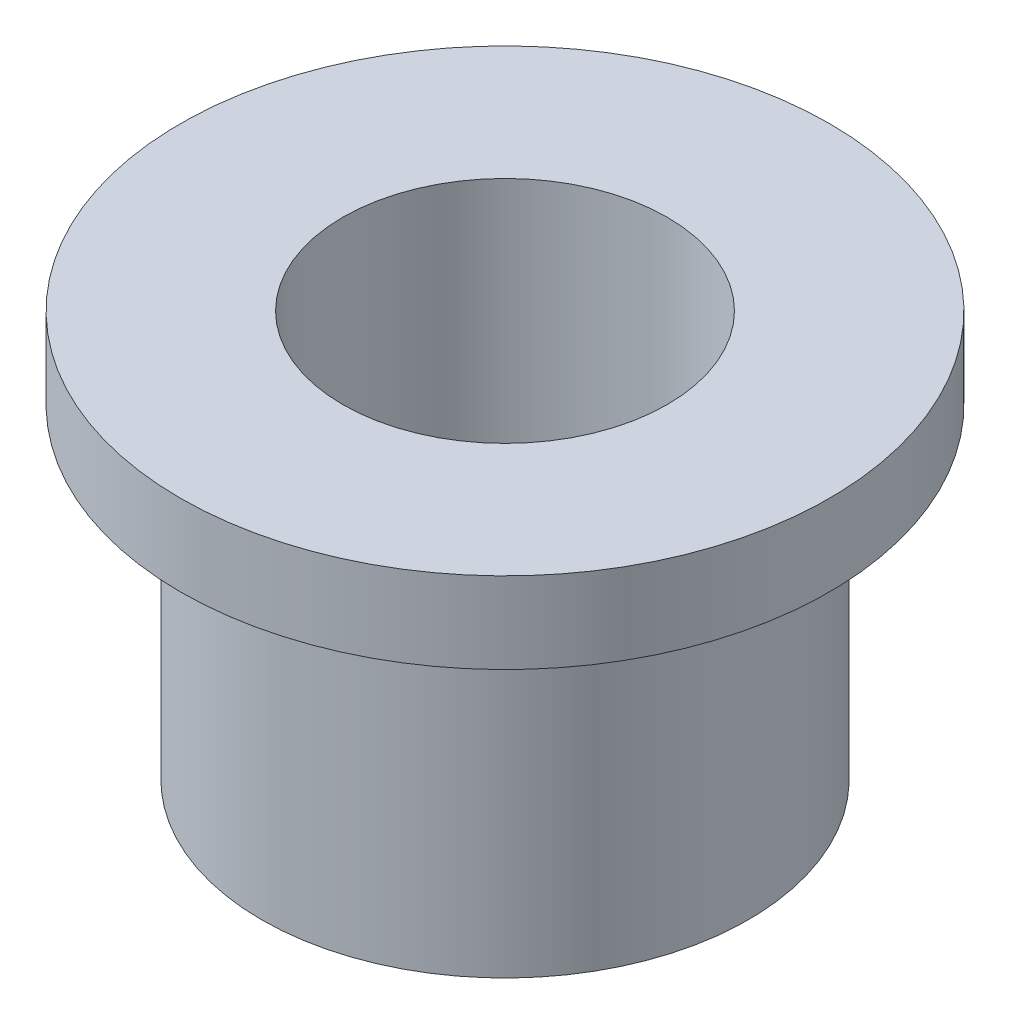
ISO-10303-21;
HEADER;
FILE_DESCRIPTION(('STEP AP214'),'2;1');
FILE_NAME('part.step','',(''),(''),'','','');
FILE_SCHEMA(('AUTOMOTIVE_DESIGN { 1 0 10303 214 1 1 1 1 }'));
ENDSEC;
DATA;
#1=APPLICATION_CONTEXT('core data for automotive mechanical design processes');
#2=APPLICATION_PROTOCOL_DEFINITION('international standard','automotive_design',2000,#1);
#3=PRODUCT_CONTEXT('',#1,'mechanical');
#4=PRODUCT('Part','Part','',(#3));
#5=PRODUCT_RELATED_PRODUCT_CATEGORY('part','',(#4));
#6=PRODUCT_DEFINITION_FORMATION('','',#4);
#7=PRODUCT_DEFINITION_CONTEXT('part definition',#1,'design');
#8=PRODUCT_DEFINITION('design','',#6,#7);
#9=PRODUCT_DEFINITION_SHAPE('','',#8);
#10=(LENGTH_UNIT() NAMED_UNIT(*) SI_UNIT(.MILLI.,.METRE.));
#11=(NAMED_UNIT(*) PLANE_ANGLE_UNIT() SI_UNIT($,.RADIAN.));
#12=(NAMED_UNIT(*) SI_UNIT($,.STERADIAN.) SOLID_ANGLE_UNIT());
#13=UNCERTAINTY_MEASURE_WITH_UNIT(LENGTH_MEASURE(1.E-05),#10,'distance_accuracy_value','');
#14=(GEOMETRIC_REPRESENTATION_CONTEXT(3) GLOBAL_UNCERTAINTY_ASSIGNED_CONTEXT((#13)) GLOBAL_UNIT_ASSIGNED_CONTEXT((#10,
#11,#12)) REPRESENTATION_CONTEXT('',''));
#15=CARTESIAN_POINT('',(0.,0.,0.));
#16=DIRECTION('',(0.,0.,1.));
#17=DIRECTION('',(1.,0.,0.));
#18=AXIS2_PLACEMENT_3D('',#15,#16,#17);
#19=CARTESIAN_POINT('',(-50.,0.,0.));
#20=DIRECTION('',(0.,-1.,0.));
#21=DIRECTION('',(0.,0.,-1.));
#22=AXIS2_PLACEMENT_3D('',#19,#20,#21);
#23=PLANE('',#22);
#24=CARTESIAN_POINT('',(0.,0.,0.));
#25=DIRECTION('',(0.,1.,0.));
#26=DIRECTION('',(0.,0.,1.));
#27=AXIS2_PLACEMENT_3D('',#24,#25,#26);
#28=CIRCLE('',#27,50.);
#29=CARTESIAN_POINT('',(0.,0.,50.));
#30=VERTEX_POINT('',#29);
#31=EDGE_CURVE('E69',#30,#30,#28,.T.);
#32=ORIENTED_EDGE('',*,*,#31,.T.);
#33=EDGE_LOOP('',(#32));
#34=FACE_BOUND('',#33,.T.);
#35=CARTESIAN_POINT('',(0.,0.,0.));
#36=DIRECTION('',(0.,1.,0.));
#37=DIRECTION('',(0.,0.,1.));
#38=AXIS2_PLACEMENT_3D('',#35,#36,#37);
#39=CIRCLE('',#38,75.);
#40=CARTESIAN_POINT('',(0.,0.,75.));
#41=VERTEX_POINT('',#40);
#42=EDGE_CURVE('E10',#41,#41,#39,.T.);
#43=ORIENTED_EDGE('',*,*,#42,.F.);
#44=EDGE_LOOP('',(#43));
#45=FACE_BOUND('',#44,.T.);
#46=ADVANCED_FACE('F41',(#34,#45),#23,.T.);
#47=CARTESIAN_POINT('',(0.,167.383783148187,0.));
#48=DIRECTION('',(0.,1.,0.));
#49=DIRECTION('',(0.,0.,1.));
#50=AXIS2_PLACEMENT_3D('',#47,#48,#49);
#51=CYLINDRICAL_SURFACE('',#50,75.);
#52=ORIENTED_EDGE('',*,*,#42,.T.);
#53=EDGE_LOOP('',(#52));
#54=FACE_BOUND('',#53,.T.);
#55=CARTESIAN_POINT('',(0.,100.,0.));
#56=DIRECTION('',(0.,1.,0.));
#57=DIRECTION('',(0.,0.,1.));
#58=AXIS2_PLACEMENT_3D('',#55,#56,#57);
#59=CIRCLE('',#58,75.);
#60=CARTESIAN_POINT('',(0.,100.,75.));
#61=VERTEX_POINT('',#60);
#62=EDGE_CURVE('E48',#61,#61,#59,.T.);
#63=ORIENTED_EDGE('',*,*,#62,.F.);
#64=EDGE_LOOP('',(#63));
#65=FACE_BOUND('',#64,.T.);
#66=ADVANCED_FACE('F86',(#54,#65),#51,.T.);
#67=CARTESIAN_POINT('',(-75.,100.,0.));
#68=DIRECTION('',(0.,-1.,0.));
#69=DIRECTION('',(0.,0.,-1.));
#70=AXIS2_PLACEMENT_3D('',#67,#68,#69);
#71=PLANE('',#70);
#72=ORIENTED_EDGE('',*,*,#62,.T.);
#73=EDGE_LOOP('',(#72));
#74=FACE_BOUND('',#73,.T.);
#75=CARTESIAN_POINT('',(0.,100.,0.));
#76=DIRECTION('',(0.,1.,0.));
#77=DIRECTION('',(0.,0.,1.));
#78=AXIS2_PLACEMENT_3D('',#75,#76,#77);
#79=CIRCLE('',#78,100.);
#80=CARTESIAN_POINT('',(0.,100.,100.));
#81=VERTEX_POINT('',#80);
#82=EDGE_CURVE('E55',#81,#81,#79,.T.);
#83=ORIENTED_EDGE('',*,*,#82,.F.);
#84=EDGE_LOOP('',(#83));
#85=FACE_BOUND('',#84,.T.);
#86=ADVANCED_FACE('F89',(#74,#85),#71,.T.);
#87=CARTESIAN_POINT('',(0.,167.383783148187,0.));
#88=DIRECTION('',(0.,1.,0.));
#89=DIRECTION('',(0.,0.,1.));
#90=AXIS2_PLACEMENT_3D('',#87,#88,#89);
#91=CYLINDRICAL_SURFACE('',#90,100.);
#92=ORIENTED_EDGE('',*,*,#82,.T.);
#93=EDGE_LOOP('',(#92));
#94=FACE_BOUND('',#93,.T.);
#95=CARTESIAN_POINT('',(0.,125.,0.));
#96=DIRECTION('',(0.,1.,0.));
#97=DIRECTION('',(0.,0.,1.));
#98=AXIS2_PLACEMENT_3D('',#95,#96,#97);
#99=CIRCLE('',#98,100.);
#100=CARTESIAN_POINT('',(0.,125.,100.));
#101=VERTEX_POINT('',#100);
#102=EDGE_CURVE('E61',#101,#101,#99,.T.);
#103=ORIENTED_EDGE('',*,*,#102,.F.);
#104=EDGE_LOOP('',(#103));
#105=FACE_BOUND('',#104,.T.);
#106=ADVANCED_FACE('F82',(#94,#105),#91,.T.);
#107=CARTESIAN_POINT('',(-100.,125.,0.));
#108=DIRECTION('',(0.,1.,0.));
#109=DIRECTION('',(0.,0.,1.));
#110=AXIS2_PLACEMENT_3D('',#107,#108,#109);
#111=PLANE('',#110);
#112=ORIENTED_EDGE('',*,*,#102,.T.);
#113=EDGE_LOOP('',(#112));
#114=FACE_BOUND('',#113,.T.);
#115=CARTESIAN_POINT('',(0.,125.,0.));
#116=DIRECTION('',(0.,1.,0.));
#117=DIRECTION('',(0.,0.,1.));
#118=AXIS2_PLACEMENT_3D('',#115,#116,#117);
#119=CIRCLE('',#118,50.);
#120=CARTESIAN_POINT('',(0.,125.,50.));
#121=VERTEX_POINT('',#120);
#122=EDGE_CURVE('E66',#121,#121,#119,.T.);
#123=ORIENTED_EDGE('',*,*,#122,.F.);
#124=EDGE_LOOP('',(#123));
#125=FACE_BOUND('',#124,.T.);
#126=ADVANCED_FACE('F77',(#114,#125),#111,.T.);
#127=CARTESIAN_POINT('',(0.,167.383783148187,0.));
#128=DIRECTION('',(0.,1.,0.));
#129=DIRECTION('',(0.,0.,1.));
#130=AXIS2_PLACEMENT_3D('',#127,#128,#129);
#131=CYLINDRICAL_SURFACE('',#130,50.);
#132=ORIENTED_EDGE('',*,*,#122,.T.);
#133=EDGE_LOOP('',(#132));
#134=FACE_BOUND('',#133,.T.);
#135=ORIENTED_EDGE('',*,*,#31,.F.);
#136=EDGE_LOOP('',(#135));
#137=FACE_BOUND('',#136,.T.);
#138=ADVANCED_FACE('F75',(#134,#137),#131,.F.);
#139=CLOSED_SHELL('',(#46,#66,#86,#106,#126,#138));
#140=MANIFOLD_SOLID_BREP('B2',#139);
#141=ADVANCED_BREP_SHAPE_REPRESENTATION('',(#18,#140),#14);
#142=SHAPE_DEFINITION_REPRESENTATION(#9,#141);
ENDSEC;
END-ISO-10303-21;
